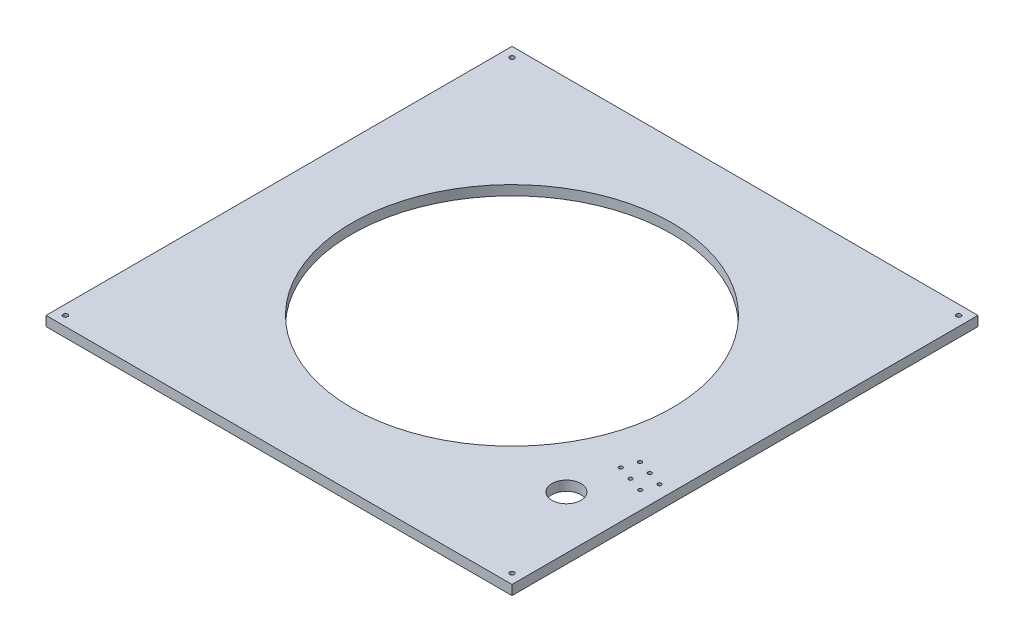
ISO-10303-21;
HEADER;
FILE_DESCRIPTION(('STEP AP214'),'2;1');
FILE_NAME('part.step','',(''),(''),'','','');
FILE_SCHEMA(('AUTOMOTIVE_DESIGN { 1 0 10303 214 1 1 1 1 }'));
ENDSEC;
DATA;
#1=APPLICATION_CONTEXT('core data for automotive mechanical design processes');
#2=APPLICATION_PROTOCOL_DEFINITION('international standard','automotive_design',2000,#1);
#3=PRODUCT_CONTEXT('',#1,'mechanical');
#4=PRODUCT('Part','Part','',(#3));
#5=PRODUCT_RELATED_PRODUCT_CATEGORY('part','',(#4));
#6=PRODUCT_DEFINITION_FORMATION('','',#4);
#7=PRODUCT_DEFINITION_CONTEXT('part definition',#1,'design');
#8=PRODUCT_DEFINITION('design','',#6,#7);
#9=PRODUCT_DEFINITION_SHAPE('','',#8);
#10=(LENGTH_UNIT() NAMED_UNIT(*) SI_UNIT(.MILLI.,.METRE.));
#11=(NAMED_UNIT(*) PLANE_ANGLE_UNIT() SI_UNIT($,.RADIAN.));
#12=(NAMED_UNIT(*) SI_UNIT($,.STERADIAN.) SOLID_ANGLE_UNIT());
#13=UNCERTAINTY_MEASURE_WITH_UNIT(LENGTH_MEASURE(1.E-05),#10,'distance_accuracy_value','');
#14=(GEOMETRIC_REPRESENTATION_CONTEXT(3) GLOBAL_UNCERTAINTY_ASSIGNED_CONTEXT((#13)) GLOBAL_UNIT_ASSIGNED_CONTEXT((#10,
#11,#12)) REPRESENTATION_CONTEXT('',''));
#15=CARTESIAN_POINT('',(0.,0.,0.));
#16=DIRECTION('',(0.,0.,1.));
#17=DIRECTION('',(1.,0.,0.));
#18=AXIS2_PLACEMENT_3D('',#15,#16,#17);
#19=CARTESIAN_POINT('',(-50.5057346041975,12.7,-44.459273419188));
#20=DIRECTION('',(1.,0.,0.));
#21=DIRECTION('',(0.,0.,-1.));
#22=AXIS2_PLACEMENT_3D('',#19,#20,#21);
#23=PLANE('',#22);
#24=DIRECTION('',(0.,0.,1.));
#25=VECTOR('',#24,1.);
#26=CARTESIAN_POINT('',(-50.5057346041975,0.,-44.459273419188));
#27=LINE('',#26,#25);
#28=CARTESIAN_POINT('',(-50.5057346041975,0.,-44.459273419188));
#29=VERTEX_POINT('',#28);
#30=CARTESIAN_POINT('',(-50.5057346041974,0.,565.140726580812));
#31=VERTEX_POINT('',#30);
#32=EDGE_CURVE('E93',#29,#31,#27,.T.);
#33=ORIENTED_EDGE('',*,*,#32,.T.);
#34=DIRECTION('',(0.,-1.,0.));
#35=VECTOR('',#34,1.);
#36=CARTESIAN_POINT('',(-50.5057346041974,12.7,565.140726580812));
#37=LINE('',#36,#35);
#38=CARTESIAN_POINT('',(-50.5057346041974,12.7,565.140726580812));
#39=VERTEX_POINT('',#38);
#40=EDGE_CURVE('E11',#39,#31,#37,.T.);
#41=ORIENTED_EDGE('',*,*,#40,.F.);
#42=DIRECTION('',(0.,0.,1.));
#43=VECTOR('',#42,1.);
#44=CARTESIAN_POINT('',(-50.5057346041975,12.7,-44.459273419188));
#45=LINE('',#44,#43);
#46=CARTESIAN_POINT('',(-50.5057346041975,12.7,-44.459273419188));
#47=VERTEX_POINT('',#46);
#48=EDGE_CURVE('E81',#47,#39,#45,.T.);
#49=ORIENTED_EDGE('',*,*,#48,.F.);
#50=DIRECTION('',(0.,-1.,0.));
#51=VECTOR('',#50,1.);
#52=CARTESIAN_POINT('',(-50.5057346041975,12.7,-44.459273419188));
#53=LINE('',#52,#51);
#54=EDGE_CURVE('E89',#47,#29,#53,.T.);
#55=ORIENTED_EDGE('',*,*,#54,.T.);
#56=EDGE_LOOP('',(#33,#41,#49,#55));
#57=FACE_BOUND('',#56,.T.);
#58=ADVANCED_FACE('F30',(#57),#23,.F.);
#59=CARTESIAN_POINT('',(-50.5057346041974,12.7,565.140726580812));
#60=DIRECTION('',(0.,0.,-1.));
#61=DIRECTION('',(-1.,0.,0.));
#62=AXIS2_PLACEMENT_3D('',#59,#60,#61);
#63=PLANE('',#62);
#64=DIRECTION('',(1.,0.,0.));
#65=VECTOR('',#64,1.);
#66=CARTESIAN_POINT('',(-50.5057346041974,0.,565.140726580812));
#67=LINE('',#66,#65);
#68=CARTESIAN_POINT('',(559.094265395803,0.,565.140726580812));
#69=VERTEX_POINT('',#68);
#70=EDGE_CURVE('E85',#31,#69,#67,.T.);
#71=ORIENTED_EDGE('',*,*,#70,.T.);
#72=DIRECTION('',(0.,-1.,0.));
#73=VECTOR('',#72,1.);
#74=CARTESIAN_POINT('',(559.094265395803,12.7,565.140726580812));
#75=LINE('',#74,#73);
#76=CARTESIAN_POINT('',(559.094265395803,12.7,565.140726580812));
#77=VERTEX_POINT('',#76);
#78=EDGE_CURVE('E38',#77,#69,#75,.T.);
#79=ORIENTED_EDGE('',*,*,#78,.F.);
#80=DIRECTION('',(1.,0.,0.));
#81=VECTOR('',#80,1.);
#82=CARTESIAN_POINT('',(-50.5057346041974,12.7,565.140726580812));
#83=LINE('',#82,#81);
#84=EDGE_CURVE('E76',#39,#77,#83,.T.);
#85=ORIENTED_EDGE('',*,*,#84,.F.);
#86=ORIENTED_EDGE('',*,*,#40,.T.);
#87=EDGE_LOOP('',(#71,#79,#85,#86));
#88=FACE_BOUND('',#87,.T.);
#89=ADVANCED_FACE('F84',(#88),#63,.F.);
#90=CARTESIAN_POINT('',(559.094265395802,12.7,-44.459273419188));
#91=DIRECTION('',(-1.,0.,0.));
#92=DIRECTION('',(0.,0.,1.));
#93=AXIS2_PLACEMENT_3D('',#90,#91,#92);
#94=PLANE('',#93);
#95=DIRECTION('',(0.,0.,-1.));
#96=VECTOR('',#95,1.);
#97=CARTESIAN_POINT('',(559.094265395802,0.,-44.459273419188));
#98=LINE('',#97,#96);
#99=CARTESIAN_POINT('',(559.094265395802,0.,-44.459273419188));
#100=VERTEX_POINT('',#99);
#101=EDGE_CURVE('E63',#69,#100,#98,.T.);
#102=ORIENTED_EDGE('',*,*,#101,.T.);
#103=DIRECTION('',(0.,-1.,0.));
#104=VECTOR('',#103,1.);
#105=CARTESIAN_POINT('',(559.094265395802,12.7,-44.459273419188));
#106=LINE('',#105,#104);
#107=CARTESIAN_POINT('',(559.094265395802,12.7,-44.459273419188));
#108=VERTEX_POINT('',#107);
#109=EDGE_CURVE('E86',#108,#100,#106,.T.);
#110=ORIENTED_EDGE('',*,*,#109,.F.);
#111=DIRECTION('',(0.,0.,-1.));
#112=VECTOR('',#111,1.);
#113=CARTESIAN_POINT('',(559.094265395802,12.7,-44.459273419188));
#114=LINE('',#113,#112);
#115=EDGE_CURVE('E79',#77,#108,#114,.T.);
#116=ORIENTED_EDGE('',*,*,#115,.F.);
#117=ORIENTED_EDGE('',*,*,#78,.T.);
#118=EDGE_LOOP('',(#102,#110,#116,#117));
#119=FACE_BOUND('',#118,.T.);
#120=ADVANCED_FACE('F87',(#119),#94,.F.);
#121=CARTESIAN_POINT('',(-50.5057346041975,12.7,-44.459273419188));
#122=DIRECTION('',(0.,0.,1.));
#123=DIRECTION('',(1.,0.,0.));
#124=AXIS2_PLACEMENT_3D('',#121,#122,#123);
#125=PLANE('',#124);
#126=DIRECTION('',(-1.,0.,0.));
#127=VECTOR('',#126,1.);
#128=CARTESIAN_POINT('',(-50.5057346041975,0.,-44.459273419188));
#129=LINE('',#128,#127);
#130=EDGE_CURVE('E69',#100,#29,#129,.T.);
#131=ORIENTED_EDGE('',*,*,#130,.T.);
#132=ORIENTED_EDGE('',*,*,#54,.F.);
#133=DIRECTION('',(-1.,0.,0.));
#134=VECTOR('',#133,1.);
#135=CARTESIAN_POINT('',(-50.5057346041975,12.7,-44.459273419188));
#136=LINE('',#135,#134);
#137=EDGE_CURVE('E46',#108,#47,#136,.T.);
#138=ORIENTED_EDGE('',*,*,#137,.F.);
#139=ORIENTED_EDGE('',*,*,#109,.T.);
#140=EDGE_LOOP('',(#131,#132,#138,#139));
#141=FACE_BOUND('',#140,.T.);
#142=ADVANCED_FACE('F101',(#141),#125,.F.);
#143=CARTESIAN_POINT('',(-50.5057346041974,12.7,565.140726580812));
#144=DIRECTION('',(0.,1.,0.));
#145=DIRECTION('',(0.,0.,1.));
#146=AXIS2_PLACEMENT_3D('',#143,#144,#145);
#147=PLANE('',#146);
#148=CARTESIAN_POINT('',(546.394265395803,12.7,-31.759273419188));
#149=DIRECTION('',(0.,1.,0.));
#150=DIRECTION('',(0.,0.,1.));
#151=AXIS2_PLACEMENT_3D('',#148,#149,#150);
#152=CIRCLE('',#151,3.00000000000005);
#153=CARTESIAN_POINT('',(546.394265395803,12.7,-28.7592734191879));
#154=VERTEX_POINT('',#153);
#155=EDGE_CURVE('E173',#154,#154,#152,.T.);
#156=ORIENTED_EDGE('',*,*,#155,.F.);
#157=EDGE_LOOP('',(#156));
#158=FACE_BOUND('',#157,.T.);
#159=CARTESIAN_POINT('',(-37.8057346041975,12.7,-31.759273419188));
#160=DIRECTION('',(0.,1.,0.));
#161=DIRECTION('',(0.,0.,1.));
#162=AXIS2_PLACEMENT_3D('',#159,#160,#161);
#163=CIRCLE('',#162,3.);
#164=CARTESIAN_POINT('',(-37.8057346041975,12.7,-28.759273419188));
#165=VERTEX_POINT('',#164);
#166=EDGE_CURVE('E167',#165,#165,#163,.T.);
#167=ORIENTED_EDGE('',*,*,#166,.F.);
#168=EDGE_LOOP('',(#167));
#169=FACE_BOUND('',#168,.T.);
#170=CARTESIAN_POINT('',(-37.8057346041975,12.7,552.440726580812));
#171=DIRECTION('',(0.,1.,0.));
#172=DIRECTION('',(0.,0.,1.));
#173=AXIS2_PLACEMENT_3D('',#170,#171,#172);
#174=CIRCLE('',#173,3.);
#175=CARTESIAN_POINT('',(-37.8057346041975,12.7,555.440726580812));
#176=VERTEX_POINT('',#175);
#177=EDGE_CURVE('E161',#176,#176,#174,.T.);
#178=ORIENTED_EDGE('',*,*,#177,.F.);
#179=EDGE_LOOP('',(#178));
#180=FACE_BOUND('',#179,.T.);
#181=CARTESIAN_POINT('',(546.394265395803,12.7,552.440726580812));
#182=DIRECTION('',(0.,1.,0.));
#183=DIRECTION('',(0.,0.,1.));
#184=AXIS2_PLACEMENT_3D('',#181,#182,#183);
#185=CIRCLE('',#184,3.00000000000005);
#186=CARTESIAN_POINT('',(546.394265395803,12.7,555.440726580812));
#187=VERTEX_POINT('',#186);
#188=EDGE_CURVE('E155',#187,#187,#185,.T.);
#189=ORIENTED_EDGE('',*,*,#188,.F.);
#190=EDGE_LOOP('',(#189));
#191=FACE_BOUND('',#190,.T.);
#192=CARTESIAN_POINT('',(535.849267397404,12.7,374.140726580812));
#193=DIRECTION('',(0.,1.,0.));
#194=DIRECTION('',(0.,0.,-1.));
#195=AXIS2_PLACEMENT_3D('',#192,#193,#194);
#196=CIRCLE('',#195,2.49999999999992);
#197=CARTESIAN_POINT('',(535.849267397404,12.7,371.640726580812));
#198=VERTEX_POINT('',#197);
#199=EDGE_CURVE('E149',#198,#198,#196,.T.);
#200=ORIENTED_EDGE('',*,*,#199,.F.);
#201=EDGE_LOOP('',(#200));
#202=FACE_BOUND('',#201,.T.);
#203=CARTESIAN_POINT('',(516.849267397404,12.7,367.895728582414));
#204=DIRECTION('',(0.,1.,0.));
#205=DIRECTION('',(0.,0.,-1.));
#206=AXIS2_PLACEMENT_3D('',#203,#204,#205);
#207=CIRCLE('',#206,2.49999999999992);
#208=CARTESIAN_POINT('',(516.849267397404,12.7,365.395728582414));
#209=VERTEX_POINT('',#208);
#210=EDGE_CURVE('E143',#209,#209,#207,.T.);
#211=ORIENTED_EDGE('',*,*,#210,.F.);
#212=EDGE_LOOP('',(#211));
#213=FACE_BOUND('',#212,.T.);
#214=CARTESIAN_POINT('',(497.849267397404,12.7,361.650730584016));
#215=DIRECTION('',(0.,1.,0.));
#216=DIRECTION('',(0.,0.,-1.));
#217=AXIS2_PLACEMENT_3D('',#214,#215,#216);
#218=CIRCLE('',#217,2.49999999999992);
#219=CARTESIAN_POINT('',(497.849267397404,12.7,359.150730584016));
#220=VERTEX_POINT('',#219);
#221=EDGE_CURVE('E137',#220,#220,#218,.T.);
#222=ORIENTED_EDGE('',*,*,#221,.F.);
#223=EDGE_LOOP('',(#222));
#224=FACE_BOUND('',#223,.T.);
#225=CARTESIAN_POINT('',(504.094265395803,12.7,342.650730584015));
#226=DIRECTION('',(0.,1.,0.));
#227=DIRECTION('',(0.,0.,1.));
#228=AXIS2_PLACEMENT_3D('',#225,#226,#227);
#229=CIRCLE('',#228,2.49999999999992);
#230=CARTESIAN_POINT('',(504.094265395803,12.7,345.150730584015));
#231=VERTEX_POINT('',#230);
#232=EDGE_CURVE('E131',#231,#231,#229,.T.);
#233=ORIENTED_EDGE('',*,*,#232,.F.);
#234=EDGE_LOOP('',(#233));
#235=FACE_BOUND('',#234,.T.);
#236=CARTESIAN_POINT('',(523.094265395803,12.7,348.895728582413));
#237=DIRECTION('',(0.,1.,0.));
#238=DIRECTION('',(0.,0.,1.));
#239=AXIS2_PLACEMENT_3D('',#236,#237,#238);
#240=CIRCLE('',#239,2.49999999999992);
#241=CARTESIAN_POINT('',(523.094265395803,12.7,351.395728582413));
#242=VERTEX_POINT('',#241);
#243=EDGE_CURVE('E125',#242,#242,#240,.T.);
#244=ORIENTED_EDGE('',*,*,#243,.F.);
#245=EDGE_LOOP('',(#244));
#246=FACE_BOUND('',#245,.T.);
#247=CARTESIAN_POINT('',(542.094265395802,12.7,355.140726580812));
#248=DIRECTION('',(0.,1.,0.));
#249=DIRECTION('',(0.,0.,1.));
#250=AXIS2_PLACEMENT_3D('',#247,#248,#249);
#251=CIRCLE('',#250,2.49999999999992);
#252=CARTESIAN_POINT('',(542.094265395802,12.7,357.640726580812));
#253=VERTEX_POINT('',#252);
#254=EDGE_CURVE('E119',#253,#253,#251,.T.);
#255=ORIENTED_EDGE('',*,*,#254,.F.);
#256=EDGE_LOOP('',(#255));
#257=FACE_BOUND('',#256,.T.);
#258=CARTESIAN_POINT('',(489.894265395803,12.7,424.740726580812));
#259=DIRECTION('',(0.,-1.,0.));
#260=DIRECTION('',(0.,0.,-1.));
#261=AXIS2_PLACEMENT_3D('',#258,#259,#260);
#262=CIRCLE('',#261,19.);
#263=CARTESIAN_POINT('',(489.894265395803,12.7,405.740726580812));
#264=VERTEX_POINT('',#263);
#265=EDGE_CURVE('E110',#264,#264,#262,.T.);
#266=ORIENTED_EDGE('',*,*,#265,.T.);
#267=EDGE_LOOP('',(#266));
#268=FACE_BOUND('',#267,.T.);
#269=CARTESIAN_POINT('',(254.294265395802,12.7,260.340726580812));
#270=DIRECTION('',(0.,1.,0.));
#271=DIRECTION('',(0.,0.,1.));
#272=AXIS2_PLACEMENT_3D('',#269,#270,#271);
#273=CIRCLE('',#272,209.55);
#274=CARTESIAN_POINT('',(254.294265395802,12.7,469.890726580812));
#275=VERTEX_POINT('',#274);
#276=EDGE_CURVE('E107',#275,#275,#273,.T.);
#277=ORIENTED_EDGE('',*,*,#276,.F.);
#278=EDGE_LOOP('',(#277));
#279=FACE_BOUND('',#278,.T.);
#280=ORIENTED_EDGE('',*,*,#48,.T.);
#281=ORIENTED_EDGE('',*,*,#84,.T.);
#282=ORIENTED_EDGE('',*,*,#115,.T.);
#283=ORIENTED_EDGE('',*,*,#137,.T.);
#284=EDGE_LOOP('',(#280,#281,#282,#283));
#285=FACE_BOUND('',#284,.T.);
#286=ADVANCED_FACE('F77',(#158,#169,#180,#191,#202,#213,#224,#235,#246,#257,#268,#279,#285),
#147,.T.);
#287=CARTESIAN_POINT('',(-50.5057346041974,0.,565.140726580812));
#288=DIRECTION('',(0.,1.,0.));
#289=DIRECTION('',(0.,0.,1.));
#290=AXIS2_PLACEMENT_3D('',#287,#288,#289);
#291=PLANE('',#290);
#292=CARTESIAN_POINT('',(546.394265395803,0.,-31.759273419188));
#293=DIRECTION('',(0.,1.,0.));
#294=DIRECTION('',(0.,0.,1.));
#295=AXIS2_PLACEMENT_3D('',#292,#293,#294);
#296=CIRCLE('',#295,3.00000000000005);
#297=CARTESIAN_POINT('',(546.394265395803,0.,-28.7592734191879));
#298=VERTEX_POINT('',#297);
#299=EDGE_CURVE('E170',#298,#298,#296,.T.);
#300=ORIENTED_EDGE('',*,*,#299,.T.);
#301=EDGE_LOOP('',(#300));
#302=FACE_BOUND('',#301,.T.);
#303=CARTESIAN_POINT('',(-37.8057346041975,0.,-31.759273419188));
#304=DIRECTION('',(0.,1.,0.));
#305=DIRECTION('',(0.,0.,1.));
#306=AXIS2_PLACEMENT_3D('',#303,#304,#305);
#307=CIRCLE('',#306,3.);
#308=CARTESIAN_POINT('',(-37.8057346041975,0.,-28.759273419188));
#309=VERTEX_POINT('',#308);
#310=EDGE_CURVE('E164',#309,#309,#307,.T.);
#311=ORIENTED_EDGE('',*,*,#310,.T.);
#312=EDGE_LOOP('',(#311));
#313=FACE_BOUND('',#312,.T.);
#314=CARTESIAN_POINT('',(-37.8057346041975,0.,552.440726580812));
#315=DIRECTION('',(0.,1.,0.));
#316=DIRECTION('',(0.,0.,1.));
#317=AXIS2_PLACEMENT_3D('',#314,#315,#316);
#318=CIRCLE('',#317,3.);
#319=CARTESIAN_POINT('',(-37.8057346041975,0.,555.440726580812));
#320=VERTEX_POINT('',#319);
#321=EDGE_CURVE('E158',#320,#320,#318,.T.);
#322=ORIENTED_EDGE('',*,*,#321,.T.);
#323=EDGE_LOOP('',(#322));
#324=FACE_BOUND('',#323,.T.);
#325=CARTESIAN_POINT('',(546.394265395803,0.,552.440726580812));
#326=DIRECTION('',(0.,1.,0.));
#327=DIRECTION('',(0.,0.,1.));
#328=AXIS2_PLACEMENT_3D('',#325,#326,#327);
#329=CIRCLE('',#328,3.00000000000005);
#330=CARTESIAN_POINT('',(546.394265395803,0.,555.440726580812));
#331=VERTEX_POINT('',#330);
#332=EDGE_CURVE('E152',#331,#331,#329,.T.);
#333=ORIENTED_EDGE('',*,*,#332,.T.);
#334=EDGE_LOOP('',(#333));
#335=FACE_BOUND('',#334,.T.);
#336=CARTESIAN_POINT('',(535.849267397404,0.,374.140726580812));
#337=DIRECTION('',(0.,1.,0.));
#338=DIRECTION('',(0.,0.,-1.));
#339=AXIS2_PLACEMENT_3D('',#336,#337,#338);
#340=CIRCLE('',#339,2.49999999999992);
#341=CARTESIAN_POINT('',(535.849267397404,0.,371.640726580812));
#342=VERTEX_POINT('',#341);
#343=EDGE_CURVE('E146',#342,#342,#340,.T.);
#344=ORIENTED_EDGE('',*,*,#343,.T.);
#345=EDGE_LOOP('',(#344));
#346=FACE_BOUND('',#345,.T.);
#347=CARTESIAN_POINT('',(516.849267397404,0.,367.895728582414));
#348=DIRECTION('',(0.,1.,0.));
#349=DIRECTION('',(0.,0.,-1.));
#350=AXIS2_PLACEMENT_3D('',#347,#348,#349);
#351=CIRCLE('',#350,2.49999999999992);
#352=CARTESIAN_POINT('',(516.849267397404,0.,365.395728582414));
#353=VERTEX_POINT('',#352);
#354=EDGE_CURVE('E140',#353,#353,#351,.T.);
#355=ORIENTED_EDGE('',*,*,#354,.T.);
#356=EDGE_LOOP('',(#355));
#357=FACE_BOUND('',#356,.T.);
#358=CARTESIAN_POINT('',(497.849267397404,0.,361.650730584016));
#359=DIRECTION('',(0.,1.,0.));
#360=DIRECTION('',(0.,0.,-1.));
#361=AXIS2_PLACEMENT_3D('',#358,#359,#360);
#362=CIRCLE('',#361,2.49999999999992);
#363=CARTESIAN_POINT('',(497.849267397404,0.,359.150730584016));
#364=VERTEX_POINT('',#363);
#365=EDGE_CURVE('E134',#364,#364,#362,.T.);
#366=ORIENTED_EDGE('',*,*,#365,.T.);
#367=EDGE_LOOP('',(#366));
#368=FACE_BOUND('',#367,.T.);
#369=CARTESIAN_POINT('',(504.094265395803,0.,342.650730584015));
#370=DIRECTION('',(0.,1.,0.));
#371=DIRECTION('',(0.,0.,1.));
#372=AXIS2_PLACEMENT_3D('',#369,#370,#371);
#373=CIRCLE('',#372,2.49999999999992);
#374=CARTESIAN_POINT('',(504.094265395803,0.,345.150730584015));
#375=VERTEX_POINT('',#374);
#376=EDGE_CURVE('E128',#375,#375,#373,.T.);
#377=ORIENTED_EDGE('',*,*,#376,.T.);
#378=EDGE_LOOP('',(#377));
#379=FACE_BOUND('',#378,.T.);
#380=CARTESIAN_POINT('',(523.094265395803,0.,348.895728582413));
#381=DIRECTION('',(0.,1.,0.));
#382=DIRECTION('',(0.,0.,1.));
#383=AXIS2_PLACEMENT_3D('',#380,#381,#382);
#384=CIRCLE('',#383,2.49999999999992);
#385=CARTESIAN_POINT('',(523.094265395803,0.,351.395728582413));
#386=VERTEX_POINT('',#385);
#387=EDGE_CURVE('E122',#386,#386,#384,.T.);
#388=ORIENTED_EDGE('',*,*,#387,.T.);
#389=EDGE_LOOP('',(#388));
#390=FACE_BOUND('',#389,.T.);
#391=CARTESIAN_POINT('',(542.094265395802,0.,355.140726580812));
#392=DIRECTION('',(0.,1.,0.));
#393=DIRECTION('',(0.,0.,1.));
#394=AXIS2_PLACEMENT_3D('',#391,#392,#393);
#395=CIRCLE('',#394,2.49999999999992);
#396=CARTESIAN_POINT('',(542.094265395802,0.,357.640726580812));
#397=VERTEX_POINT('',#396);
#398=EDGE_CURVE('E116',#397,#397,#395,.T.);
#399=ORIENTED_EDGE('',*,*,#398,.T.);
#400=EDGE_LOOP('',(#399));
#401=FACE_BOUND('',#400,.T.);
#402=CARTESIAN_POINT('',(489.894265395803,0.,424.740726580812));
#403=DIRECTION('',(0.,-1.,0.));
#404=DIRECTION('',(0.,0.,-1.));
#405=AXIS2_PLACEMENT_3D('',#402,#403,#404);
#406=CIRCLE('',#405,19.);
#407=CARTESIAN_POINT('',(489.894265395803,0.,405.740726580812));
#408=VERTEX_POINT('',#407);
#409=EDGE_CURVE('E113',#408,#408,#406,.T.);
#410=ORIENTED_EDGE('',*,*,#409,.F.);
#411=EDGE_LOOP('',(#410));
#412=FACE_BOUND('',#411,.T.);
#413=CARTESIAN_POINT('',(254.294265395802,0.,260.340726580812));
#414=DIRECTION('',(0.,1.,0.));
#415=DIRECTION('',(0.,0.,1.));
#416=AXIS2_PLACEMENT_3D('',#413,#414,#415);
#417=CIRCLE('',#416,209.55);
#418=CARTESIAN_POINT('',(254.294265395802,0.,469.890726580812));
#419=VERTEX_POINT('',#418);
#420=EDGE_CURVE('E96',#419,#419,#417,.T.);
#421=ORIENTED_EDGE('',*,*,#420,.T.);
#422=EDGE_LOOP('',(#421));
#423=FACE_BOUND('',#422,.T.);
#424=ORIENTED_EDGE('',*,*,#32,.F.);
#425=ORIENTED_EDGE('',*,*,#130,.F.);
#426=ORIENTED_EDGE('',*,*,#101,.F.);
#427=ORIENTED_EDGE('',*,*,#70,.F.);
#428=EDGE_LOOP('',(#424,#425,#426,#427));
#429=FACE_BOUND('',#428,.T.);
#430=ADVANCED_FACE('F104',(#302,#313,#324,#335,#346,#357,#368,#379,#390,#401,#412,#423,#429),
#291,.F.);
#431=CARTESIAN_POINT('',(254.294265395802,0.,260.340726580812));
#432=DIRECTION('',(0.,1.,0.));
#433=DIRECTION('',(0.,0.,1.));
#434=AXIS2_PLACEMENT_3D('',#431,#432,#433);
#435=CYLINDRICAL_SURFACE('',#434,209.55);
#436=ORIENTED_EDGE('',*,*,#420,.F.);
#437=EDGE_LOOP('',(#436));
#438=FACE_BOUND('',#437,.T.);
#439=ORIENTED_EDGE('',*,*,#276,.T.);
#440=EDGE_LOOP('',(#439));
#441=FACE_BOUND('',#440,.T.);
#442=ADVANCED_FACE('F213',(#438,#441),#435,.F.);
#443=CARTESIAN_POINT('',(489.894265395803,12.7,424.740726580812));
#444=DIRECTION('',(0.,-1.,0.));
#445=DIRECTION('',(0.,0.,-1.));
#446=AXIS2_PLACEMENT_3D('',#443,#444,#445);
#447=CYLINDRICAL_SURFACE('',#446,19.);
#448=ORIENTED_EDGE('',*,*,#265,.F.);
#449=EDGE_LOOP('',(#448));
#450=FACE_BOUND('',#449,.T.);
#451=ORIENTED_EDGE('',*,*,#409,.T.);
#452=EDGE_LOOP('',(#451));
#453=FACE_BOUND('',#452,.T.);
#454=ADVANCED_FACE('F215',(#450,#453),#447,.F.);
#455=CARTESIAN_POINT('',(542.094265395802,0.,355.140726580812));
#456=DIRECTION('',(0.,1.,0.));
#457=DIRECTION('',(0.,0.,1.));
#458=AXIS2_PLACEMENT_3D('',#455,#456,#457);
#459=CYLINDRICAL_SURFACE('',#458,2.49999999999992);
#460=ORIENTED_EDGE('',*,*,#398,.F.);
#461=EDGE_LOOP('',(#460));
#462=FACE_BOUND('',#461,.T.);
#463=ORIENTED_EDGE('',*,*,#254,.T.);
#464=EDGE_LOOP('',(#463));
#465=FACE_BOUND('',#464,.T.);
#466=ADVANCED_FACE('F222',(#462,#465),#459,.F.);
#467=CARTESIAN_POINT('',(523.094265395803,0.,348.895728582413));
#468=DIRECTION('',(0.,1.,0.));
#469=DIRECTION('',(0.,0.,1.));
#470=AXIS2_PLACEMENT_3D('',#467,#468,#469);
#471=CYLINDRICAL_SURFACE('',#470,2.49999999999992);
#472=ORIENTED_EDGE('',*,*,#387,.F.);
#473=EDGE_LOOP('',(#472));
#474=FACE_BOUND('',#473,.T.);
#475=ORIENTED_EDGE('',*,*,#243,.T.);
#476=EDGE_LOOP('',(#475));
#477=FACE_BOUND('',#476,.T.);
#478=ADVANCED_FACE('F309',(#474,#477),#471,.F.);
#479=CARTESIAN_POINT('',(504.094265395803,0.,342.650730584015));
#480=DIRECTION('',(0.,1.,0.));
#481=DIRECTION('',(0.,0.,1.));
#482=AXIS2_PLACEMENT_3D('',#479,#480,#481);
#483=CYLINDRICAL_SURFACE('',#482,2.49999999999992);
#484=ORIENTED_EDGE('',*,*,#376,.F.);
#485=EDGE_LOOP('',(#484));
#486=FACE_BOUND('',#485,.T.);
#487=ORIENTED_EDGE('',*,*,#232,.T.);
#488=EDGE_LOOP('',(#487));
#489=FACE_BOUND('',#488,.T.);
#490=ADVANCED_FACE('F305',(#486,#489),#483,.F.);
#491=CARTESIAN_POINT('',(497.849267397404,0.,361.650730584016));
#492=DIRECTION('',(0.,1.,0.));
#493=DIRECTION('',(0.,0.,1.));
#494=AXIS2_PLACEMENT_3D('',#491,#492,#493);
#495=CYLINDRICAL_SURFACE('',#494,2.49999999999992);
#496=ORIENTED_EDGE('',*,*,#365,.F.);
#497=EDGE_LOOP('',(#496));
#498=FACE_BOUND('',#497,.T.);
#499=ORIENTED_EDGE('',*,*,#221,.T.);
#500=EDGE_LOOP('',(#499));
#501=FACE_BOUND('',#500,.T.);
#502=ADVANCED_FACE('F301',(#498,#501),#495,.F.);
#503=CARTESIAN_POINT('',(516.849267397404,0.,367.895728582414));
#504=DIRECTION('',(0.,1.,0.));
#505=DIRECTION('',(0.,0.,1.));
#506=AXIS2_PLACEMENT_3D('',#503,#504,#505);
#507=CYLINDRICAL_SURFACE('',#506,2.49999999999992);
#508=ORIENTED_EDGE('',*,*,#354,.F.);
#509=EDGE_LOOP('',(#508));
#510=FACE_BOUND('',#509,.T.);
#511=ORIENTED_EDGE('',*,*,#210,.T.);
#512=EDGE_LOOP('',(#511));
#513=FACE_BOUND('',#512,.T.);
#514=ADVANCED_FACE('F297',(#510,#513),#507,.F.);
#515=CARTESIAN_POINT('',(535.849267397404,0.,374.140726580812));
#516=DIRECTION('',(0.,1.,0.));
#517=DIRECTION('',(0.,0.,1.));
#518=AXIS2_PLACEMENT_3D('',#515,#516,#517);
#519=CYLINDRICAL_SURFACE('',#518,2.49999999999992);
#520=ORIENTED_EDGE('',*,*,#343,.F.);
#521=EDGE_LOOP('',(#520));
#522=FACE_BOUND('',#521,.T.);
#523=ORIENTED_EDGE('',*,*,#199,.T.);
#524=EDGE_LOOP('',(#523));
#525=FACE_BOUND('',#524,.T.);
#526=ADVANCED_FACE('F262',(#522,#525),#519,.F.);
#527=CARTESIAN_POINT('',(546.394265395803,0.,552.440726580812));
#528=DIRECTION('',(0.,1.,0.));
#529=DIRECTION('',(0.,0.,1.));
#530=AXIS2_PLACEMENT_3D('',#527,#528,#529);
#531=CYLINDRICAL_SURFACE('',#530,3.00000000000005);
#532=ORIENTED_EDGE('',*,*,#332,.F.);
#533=EDGE_LOOP('',(#532));
#534=FACE_BOUND('',#533,.T.);
#535=ORIENTED_EDGE('',*,*,#188,.T.);
#536=EDGE_LOOP('',(#535));
#537=FACE_BOUND('',#536,.T.);
#538=ADVANCED_FACE('F256',(#534,#537),#531,.F.);
#539=CARTESIAN_POINT('',(-37.8057346041975,0.,552.440726580812));
#540=DIRECTION('',(0.,1.,0.));
#541=DIRECTION('',(0.,0.,1.));
#542=AXIS2_PLACEMENT_3D('',#539,#540,#541);
#543=CYLINDRICAL_SURFACE('',#542,3.);
#544=ORIENTED_EDGE('',*,*,#321,.F.);
#545=EDGE_LOOP('',(#544));
#546=FACE_BOUND('',#545,.T.);
#547=ORIENTED_EDGE('',*,*,#177,.T.);
#548=EDGE_LOOP('',(#547));
#549=FACE_BOUND('',#548,.T.);
#550=ADVANCED_FACE('F261',(#546,#549),#543,.F.);
#551=CARTESIAN_POINT('',(-37.8057346041975,0.,-31.759273419188));
#552=DIRECTION('',(0.,1.,0.));
#553=DIRECTION('',(0.,0.,1.));
#554=AXIS2_PLACEMENT_3D('',#551,#552,#553);
#555=CYLINDRICAL_SURFACE('',#554,3.);
#556=ORIENTED_EDGE('',*,*,#310,.F.);
#557=EDGE_LOOP('',(#556));
#558=FACE_BOUND('',#557,.T.);
#559=ORIENTED_EDGE('',*,*,#166,.T.);
#560=EDGE_LOOP('',(#559));
#561=FACE_BOUND('',#560,.T.);
#562=ADVANCED_FACE('F184',(#558,#561),#555,.F.);
#563=CARTESIAN_POINT('',(546.394265395803,0.,-31.759273419188));
#564=DIRECTION('',(0.,1.,0.));
#565=DIRECTION('',(0.,0.,1.));
#566=AXIS2_PLACEMENT_3D('',#563,#564,#565);
#567=CYLINDRICAL_SURFACE('',#566,3.00000000000005);
#568=ORIENTED_EDGE('',*,*,#299,.F.);
#569=EDGE_LOOP('',(#568));
#570=FACE_BOUND('',#569,.T.);
#571=ORIENTED_EDGE('',*,*,#155,.T.);
#572=EDGE_LOOP('',(#571));
#573=FACE_BOUND('',#572,.T.);
#574=ADVANCED_FACE('F181',(#570,#573),#567,.F.);
#575=CLOSED_SHELL('',(#58,#89,#120,#142,#286,#430,#442,#454,#466,#478,#490,#502,#514,#526,#538,
#550,#562,#574));
#576=MANIFOLD_SOLID_BREP('B2',#575);
#577=ADVANCED_BREP_SHAPE_REPRESENTATION('',(#18,#576),#14);
#578=SHAPE_DEFINITION_REPRESENTATION(#9,#577);
ENDSEC;
END-ISO-10303-21;
